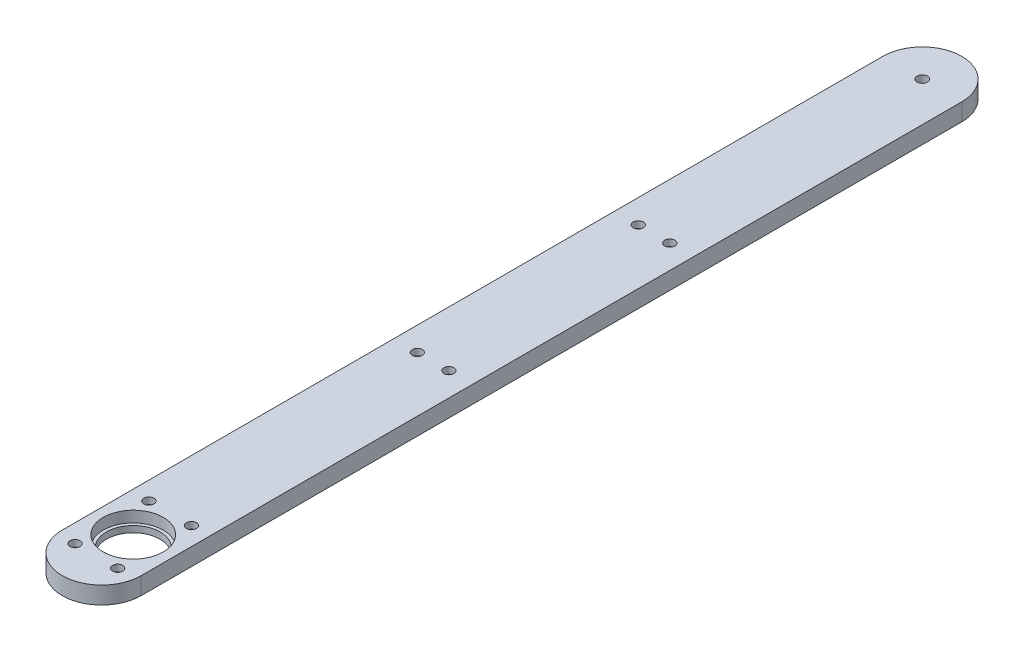
ISO-10303-21;
HEADER;
FILE_DESCRIPTION(('STEP AP214'),'2;1');
FILE_NAME('part.step','',(''),(''),'','','');
FILE_SCHEMA(('AUTOMOTIVE_DESIGN { 1 0 10303 214 1 1 1 1 }'));
ENDSEC;
DATA;
#1=APPLICATION_CONTEXT('core data for automotive mechanical design processes');
#2=APPLICATION_PROTOCOL_DEFINITION('international standard','automotive_design',2000,#1);
#3=PRODUCT_CONTEXT('',#1,'mechanical');
#4=PRODUCT('Part','Part','',(#3));
#5=PRODUCT_RELATED_PRODUCT_CATEGORY('part','',(#4));
#6=PRODUCT_DEFINITION_FORMATION('','',#4);
#7=PRODUCT_DEFINITION_CONTEXT('part definition',#1,'design');
#8=PRODUCT_DEFINITION('design','',#6,#7);
#9=PRODUCT_DEFINITION_SHAPE('','',#8);
#10=(LENGTH_UNIT() NAMED_UNIT(*) SI_UNIT(.MILLI.,.METRE.));
#11=(NAMED_UNIT(*) PLANE_ANGLE_UNIT() SI_UNIT($,.RADIAN.));
#12=(NAMED_UNIT(*) SI_UNIT($,.STERADIAN.) SOLID_ANGLE_UNIT());
#13=UNCERTAINTY_MEASURE_WITH_UNIT(LENGTH_MEASURE(1.E-05),#10,'distance_accuracy_value','');
#14=(GEOMETRIC_REPRESENTATION_CONTEXT(3) GLOBAL_UNCERTAINTY_ASSIGNED_CONTEXT((#13)) GLOBAL_UNIT_ASSIGNED_CONTEXT((#10,
#11,#12)) REPRESENTATION_CONTEXT('',''));
#15=CARTESIAN_POINT('',(0.,0.,0.));
#16=DIRECTION('',(0.,0.,1.));
#17=DIRECTION('',(1.,0.,0.));
#18=AXIS2_PLACEMENT_3D('',#15,#16,#17);
#19=CARTESIAN_POINT('',(5.00000000000004,-4.5,155.));
#20=DIRECTION('',(0.,-1.,0.));
#21=DIRECTION('',(0.,0.,-1.));
#22=AXIS2_PLACEMENT_3D('',#19,#20,#21);
#23=CYLINDRICAL_SURFACE('',#22,3.25);
#24=CARTESIAN_POINT('',(5.00000000000004,-1.1,155.));
#25=DIRECTION('',(0.,-1.,0.));
#26=DIRECTION('',(0.,0.,-1.));
#27=AXIS2_PLACEMENT_3D('',#24,#25,#26);
#28=CIRCLE('',#27,3.25);
#29=CARTESIAN_POINT('',(5.00000000000004,-1.1,151.75));
#30=VERTEX_POINT('',#29);
#31=EDGE_CURVE('E11',#30,#30,#28,.T.);
#32=ORIENTED_EDGE('',*,*,#31,.F.);
#33=EDGE_LOOP('',(#32));
#34=FACE_BOUND('',#33,.T.);
#35=CARTESIAN_POINT('',(5.00000000000004,-4.5,155.));
#36=DIRECTION('',(0.,-1.,0.));
#37=DIRECTION('',(0.,0.,-1.));
#38=AXIS2_PLACEMENT_3D('',#35,#36,#37);
#39=CIRCLE('',#38,3.25);
#40=CARTESIAN_POINT('',(5.00000000000004,-4.5,151.75));
#41=VERTEX_POINT('',#40);
#42=EDGE_CURVE('E173',#41,#41,#39,.T.);
#43=ORIENTED_EDGE('',*,*,#42,.T.);
#44=EDGE_LOOP('',(#43));
#45=FACE_BOUND('',#44,.T.);
#46=ADVANCED_FACE('F44',(#34,#45),#23,.F.);
#47=CARTESIAN_POINT('',(6.60000000000004,-1.1,155.));
#48=DIRECTION('',(0.,1.,0.));
#49=DIRECTION('',(0.,0.,1.));
#50=AXIS2_PLACEMENT_3D('',#47,#48,#49);
#51=PLANE('',#50);
#52=CARTESIAN_POINT('',(5.00000000000004,-1.1,155.));
#53=DIRECTION('',(0.,-1.,0.));
#54=DIRECTION('',(0.,0.,-1.));
#55=AXIS2_PLACEMENT_3D('',#52,#53,#54);
#56=CIRCLE('',#55,1.6);
#57=CARTESIAN_POINT('',(5.00000000000004,-1.1,153.4));
#58=VERTEX_POINT('',#57);
#59=EDGE_CURVE('E52',#58,#58,#56,.T.);
#60=ORIENTED_EDGE('',*,*,#59,.F.);
#61=EDGE_LOOP('',(#60));
#62=FACE_BOUND('',#61,.T.);
#63=ORIENTED_EDGE('',*,*,#31,.T.);
#64=EDGE_LOOP('',(#63));
#65=FACE_BOUND('',#64,.T.);
#66=ADVANCED_FACE('F187',(#62,#65),#51,.F.);
#67=CARTESIAN_POINT('',(5.00000000000004,-4.5,155.));
#68=DIRECTION('',(0.,-1.,0.));
#69=DIRECTION('',(0.,0.,-1.));
#70=AXIS2_PLACEMENT_3D('',#67,#68,#69);
#71=CYLINDRICAL_SURFACE('',#70,1.6);
#72=CARTESIAN_POINT('',(5.00000000000004,1.,155.));
#73=DIRECTION('',(0.,-1.,0.));
#74=DIRECTION('',(0.,0.,-1.));
#75=AXIS2_PLACEMENT_3D('',#72,#73,#74);
#76=CIRCLE('',#75,1.6);
#77=CARTESIAN_POINT('',(5.00000000000004,1.,153.4));
#78=VERTEX_POINT('',#77);
#79=EDGE_CURVE('E177',#78,#78,#76,.T.);
#80=ORIENTED_EDGE('',*,*,#79,.F.);
#81=EDGE_LOOP('',(#80));
#82=FACE_BOUND('',#81,.T.);
#83=ORIENTED_EDGE('',*,*,#59,.T.);
#84=EDGE_LOOP('',(#83));
#85=FACE_BOUND('',#84,.T.);
#86=ADVANCED_FACE('F185',(#82,#85),#71,.F.);
#87=CARTESIAN_POINT('',(5.00000000000002,-4.5,85.));
#88=DIRECTION('',(0.,-1.,0.));
#89=DIRECTION('',(0.,0.,-1.));
#90=AXIS2_PLACEMENT_3D('',#87,#88,#89);
#91=CYLINDRICAL_SURFACE('',#90,3.25);
#92=CARTESIAN_POINT('',(5.00000000000002,-1.1,85.));
#93=DIRECTION('',(0.,-1.,0.));
#94=DIRECTION('',(0.,0.,-1.));
#95=AXIS2_PLACEMENT_3D('',#92,#93,#94);
#96=CIRCLE('',#95,3.25);
#97=CARTESIAN_POINT('',(5.00000000000002,-1.1,81.75));
#98=VERTEX_POINT('',#97);
#99=EDGE_CURVE('E169',#98,#98,#96,.T.);
#100=ORIENTED_EDGE('',*,*,#99,.F.);
#101=EDGE_LOOP('',(#100));
#102=FACE_BOUND('',#101,.T.);
#103=CARTESIAN_POINT('',(5.00000000000002,-4.5,85.));
#104=DIRECTION('',(0.,-1.,0.));
#105=DIRECTION('',(0.,0.,-1.));
#106=AXIS2_PLACEMENT_3D('',#103,#104,#105);
#107=CIRCLE('',#106,3.25);
#108=CARTESIAN_POINT('',(5.00000000000002,-4.5,81.75));
#109=VERTEX_POINT('',#108);
#110=EDGE_CURVE('E157',#109,#109,#107,.T.);
#111=ORIENTED_EDGE('',*,*,#110,.T.);
#112=EDGE_LOOP('',(#111));
#113=FACE_BOUND('',#112,.T.);
#114=ADVANCED_FACE('F252',(#102,#113),#91,.F.);
#115=CARTESIAN_POINT('',(6.60000000000002,-1.1,85.));
#116=DIRECTION('',(0.,1.,0.));
#117=DIRECTION('',(0.,0.,1.));
#118=AXIS2_PLACEMENT_3D('',#115,#116,#117);
#119=PLANE('',#118);
#120=CARTESIAN_POINT('',(5.00000000000002,-1.1,85.));
#121=DIRECTION('',(0.,-1.,0.));
#122=DIRECTION('',(0.,0.,-1.));
#123=AXIS2_PLACEMENT_3D('',#120,#121,#122);
#124=CIRCLE('',#123,1.6);
#125=CARTESIAN_POINT('',(5.00000000000002,-1.1,83.4));
#126=VERTEX_POINT('',#125);
#127=EDGE_CURVE('E165',#126,#126,#124,.T.);
#128=ORIENTED_EDGE('',*,*,#127,.F.);
#129=EDGE_LOOP('',(#128));
#130=FACE_BOUND('',#129,.T.);
#131=ORIENTED_EDGE('',*,*,#99,.T.);
#132=EDGE_LOOP('',(#131));
#133=FACE_BOUND('',#132,.T.);
#134=ADVANCED_FACE('F248',(#130,#133),#119,.F.);
#135=CARTESIAN_POINT('',(5.00000000000002,-4.5,85.));
#136=DIRECTION('',(0.,-1.,0.));
#137=DIRECTION('',(0.,0.,-1.));
#138=AXIS2_PLACEMENT_3D('',#135,#136,#137);
#139=CYLINDRICAL_SURFACE('',#138,1.6);
#140=CARTESIAN_POINT('',(5.00000000000002,1.,85.));
#141=DIRECTION('',(0.,-1.,0.));
#142=DIRECTION('',(0.,0.,-1.));
#143=AXIS2_PLACEMENT_3D('',#140,#141,#142);
#144=CIRCLE('',#143,1.6);
#145=CARTESIAN_POINT('',(5.00000000000002,1.,83.4));
#146=VERTEX_POINT('',#145);
#147=EDGE_CURVE('E161',#146,#146,#144,.T.);
#148=ORIENTED_EDGE('',*,*,#147,.F.);
#149=EDGE_LOOP('',(#148));
#150=FACE_BOUND('',#149,.T.);
#151=ORIENTED_EDGE('',*,*,#127,.T.);
#152=EDGE_LOOP('',(#151));
#153=FACE_BOUND('',#152,.T.);
#154=ADVANCED_FACE('F244',(#150,#153),#139,.F.);
#155=CARTESIAN_POINT('',(-4.99999999999996,-4.5,155.));
#156=DIRECTION('',(0.,-1.,0.));
#157=DIRECTION('',(0.,0.,-1.));
#158=AXIS2_PLACEMENT_3D('',#155,#156,#157);
#159=CYLINDRICAL_SURFACE('',#158,3.25);
#160=CARTESIAN_POINT('',(-4.99999999999996,-1.1,155.));
#161=DIRECTION('',(0.,-1.,0.));
#162=DIRECTION('',(0.,0.,-1.));
#163=AXIS2_PLACEMENT_3D('',#160,#161,#162);
#164=CIRCLE('',#163,3.25);
#165=CARTESIAN_POINT('',(-4.99999999999996,-1.1,151.75));
#166=VERTEX_POINT('',#165);
#167=EDGE_CURVE('E153',#166,#166,#164,.T.);
#168=ORIENTED_EDGE('',*,*,#167,.F.);
#169=EDGE_LOOP('',(#168));
#170=FACE_BOUND('',#169,.T.);
#171=CARTESIAN_POINT('',(-4.99999999999996,-4.5,155.));
#172=DIRECTION('',(0.,-1.,0.));
#173=DIRECTION('',(0.,0.,-1.));
#174=AXIS2_PLACEMENT_3D('',#171,#172,#173);
#175=CIRCLE('',#174,3.25);
#176=CARTESIAN_POINT('',(-4.99999999999996,-4.5,151.75));
#177=VERTEX_POINT('',#176);
#178=EDGE_CURVE('E141',#177,#177,#175,.T.);
#179=ORIENTED_EDGE('',*,*,#178,.T.);
#180=EDGE_LOOP('',(#179));
#181=FACE_BOUND('',#180,.T.);
#182=ADVANCED_FACE('F240',(#170,#181),#159,.F.);
#183=CARTESIAN_POINT('',(-3.39999999999996,-1.1,155.));
#184=DIRECTION('',(0.,1.,0.));
#185=DIRECTION('',(0.,0.,1.));
#186=AXIS2_PLACEMENT_3D('',#183,#184,#185);
#187=PLANE('',#186);
#188=CARTESIAN_POINT('',(-4.99999999999996,-1.1,155.));
#189=DIRECTION('',(0.,-1.,0.));
#190=DIRECTION('',(0.,0.,-1.));
#191=AXIS2_PLACEMENT_3D('',#188,#189,#190);
#192=CIRCLE('',#191,1.6);
#193=CARTESIAN_POINT('',(-4.99999999999996,-1.1,153.4));
#194=VERTEX_POINT('',#193);
#195=EDGE_CURVE('E149',#194,#194,#192,.T.);
#196=ORIENTED_EDGE('',*,*,#195,.F.);
#197=EDGE_LOOP('',(#196));
#198=FACE_BOUND('',#197,.T.);
#199=ORIENTED_EDGE('',*,*,#167,.T.);
#200=EDGE_LOOP('',(#199));
#201=FACE_BOUND('',#200,.T.);
#202=ADVANCED_FACE('F209',(#198,#201),#187,.F.);
#203=CARTESIAN_POINT('',(-4.99999999999996,-4.5,155.));
#204=DIRECTION('',(0.,-1.,0.));
#205=DIRECTION('',(0.,0.,-1.));
#206=AXIS2_PLACEMENT_3D('',#203,#204,#205);
#207=CYLINDRICAL_SURFACE('',#206,1.6);
#208=CARTESIAN_POINT('',(-4.99999999999996,1.,155.));
#209=DIRECTION('',(0.,-1.,0.));
#210=DIRECTION('',(0.,0.,-1.));
#211=AXIS2_PLACEMENT_3D('',#208,#209,#210);
#212=CIRCLE('',#211,1.6);
#213=CARTESIAN_POINT('',(-4.99999999999996,1.,153.4));
#214=VERTEX_POINT('',#213);
#215=EDGE_CURVE('E145',#214,#214,#212,.T.);
#216=ORIENTED_EDGE('',*,*,#215,.F.);
#217=EDGE_LOOP('',(#216));
#218=FACE_BOUND('',#217,.T.);
#219=ORIENTED_EDGE('',*,*,#195,.T.);
#220=EDGE_LOOP('',(#219));
#221=FACE_BOUND('',#220,.T.);
#222=ADVANCED_FACE('F199',(#218,#221),#207,.F.);
#223=CARTESIAN_POINT('',(0.,-4.5,0.));
#224=DIRECTION('',(0.,1.,0.));
#225=DIRECTION('',(0.,0.,1.));
#226=AXIS2_PLACEMENT_3D('',#223,#224,#225);
#227=PLANE('',#226);
#228=CARTESIAN_POINT('',(-4.99999999999998,-4.5,85.));
#229=DIRECTION('',(0.,-1.,0.));
#230=DIRECTION('',(0.,0.,-1.));
#231=AXIS2_PLACEMENT_3D('',#228,#229,#230);
#232=CIRCLE('',#231,3.25);
#233=CARTESIAN_POINT('',(-4.99999999999998,-4.5,81.75));
#234=VERTEX_POINT('',#233);
#235=EDGE_CURVE('E404',#234,#234,#232,.T.);
#236=ORIENTED_EDGE('',*,*,#235,.F.);
#237=EDGE_LOOP('',(#236));
#238=FACE_BOUND('',#237,.T.);
#239=CARTESIAN_POINT('',(-6.7499999999999,-4.5,238.30865704891));
#240=DIRECTION('',(0.,-1.,0.));
#241=DIRECTION('',(0.,0.,-1.));
#242=AXIS2_PLACEMENT_3D('',#239,#240,#241);
#243=CIRCLE('',#242,3.25);
#244=CARTESIAN_POINT('',(-6.7499999999999,-4.5,235.05865704891));
#245=VERTEX_POINT('',#244);
#246=EDGE_CURVE('E357',#245,#245,#243,.T.);
#247=ORIENTED_EDGE('',*,*,#246,.F.);
#248=EDGE_LOOP('',(#247));
#249=FACE_BOUND('',#248,.T.);
#250=CARTESIAN_POINT('',(-6.75,-4.5,261.69134295109));
#251=DIRECTION('',(0.,-1.,0.));
#252=DIRECTION('',(0.,0.,-1.));
#253=AXIS2_PLACEMENT_3D('',#250,#251,#252);
#254=CIRCLE('',#253,3.25);
#255=CARTESIAN_POINT('',(-6.75,-4.5,258.44134295109));
#256=VERTEX_POINT('',#255);
#257=EDGE_CURVE('E341',#256,#256,#254,.T.);
#258=ORIENTED_EDGE('',*,*,#257,.F.);
#259=EDGE_LOOP('',(#258));
#260=FACE_BOUND('',#259,.T.);
#261=CARTESIAN_POINT('',(0.,-4.5,0.));
#262=DIRECTION('',(0.,1.,0.));
#263=DIRECTION('',(0.,0.,1.));
#264=AXIS2_PLACEMENT_3D('',#261,#262,#263);
#265=CIRCLE('',#264,6.);
#266=CARTESIAN_POINT('',(0.,-4.5,6.));
#267=VERTEX_POINT('',#266);
#268=EDGE_CURVE('E124',#267,#267,#265,.F.);
#269=ORIENTED_EDGE('',*,*,#268,.F.);
#270=EDGE_LOOP('',(#269));
#271=FACE_BOUND('',#270,.T.);
#272=CARTESIAN_POINT('',(0.,-4.5,0.));
#273=DIRECTION('',(0.,1.,0.));
#274=DIRECTION('',(0.,0.,1.));
#275=AXIS2_PLACEMENT_3D('',#272,#273,#274);
#276=CIRCLE('',#275,12.5);
#277=CARTESIAN_POINT('',(12.5,-4.5,0.));
#278=VERTEX_POINT('',#277);
#279=CARTESIAN_POINT('',(-12.5,-4.5,0.));
#280=VERTEX_POINT('',#279);
#281=EDGE_CURVE('E291',#278,#280,#276,.T.);
#282=ORIENTED_EDGE('',*,*,#281,.F.);
#283=DIRECTION('',(0.,0.,-1.));
#284=VECTOR('',#283,1.);
#285=CARTESIAN_POINT('',(12.5,-4.5,0.));
#286=LINE('',#285,#284);
#287=CARTESIAN_POINT('',(12.5,-4.5,260.));
#288=VERTEX_POINT('',#287);
#289=EDGE_CURVE('E116',#288,#278,#286,.T.);
#290=ORIENTED_EDGE('',*,*,#289,.F.);
#291=CARTESIAN_POINT('',(0.,-4.5,260.));
#292=DIRECTION('',(0.,1.,0.));
#293=DIRECTION('',(0.,0.,1.));
#294=AXIS2_PLACEMENT_3D('',#291,#292,#293);
#295=CIRCLE('',#294,12.5);
#296=CARTESIAN_POINT('',(-12.4999999999999,-4.5,260.));
#297=VERTEX_POINT('',#296);
#298=EDGE_CURVE('E304',#297,#288,#295,.T.);
#299=ORIENTED_EDGE('',*,*,#298,.F.);
#300=DIRECTION('',(0.,0.,1.));
#301=VECTOR('',#300,1.);
#302=CARTESIAN_POINT('',(-12.5,-4.5,0.));
#303=LINE('',#302,#301);
#304=EDGE_CURVE('E108',#280,#297,#303,.T.);
#305=ORIENTED_EDGE('',*,*,#304,.F.);
#306=EDGE_LOOP('',(#282,#290,#299,#305));
#307=FACE_BOUND('',#306,.T.);
#308=CARTESIAN_POINT('',(0.,-4.5,250.));
#309=DIRECTION('',(0.,-1.,0.));
#310=DIRECTION('',(0.,0.,-1.));
#311=AXIS2_PLACEMENT_3D('',#308,#309,#310);
#312=CIRCLE('',#311,8.5);
#313=CARTESIAN_POINT('',(0.,-4.5,241.5));
#314=VERTEX_POINT('',#313);
#315=EDGE_CURVE('E322',#314,#314,#312,.T.);
#316=ORIENTED_EDGE('',*,*,#315,.F.);
#317=EDGE_LOOP('',(#316));
#318=FACE_BOUND('',#317,.T.);
#319=CARTESIAN_POINT('',(6.75000000000005,-4.5,238.30865704891));
#320=DIRECTION('',(0.,-1.,0.));
#321=DIRECTION('',(0.,0.,-1.));
#322=AXIS2_PLACEMENT_3D('',#319,#320,#321);
#323=CIRCLE('',#322,3.25);
#324=CARTESIAN_POINT('',(6.75000000000005,-4.5,235.05865704891));
#325=VERTEX_POINT('',#324);
#326=EDGE_CURVE('E373',#325,#325,#323,.T.);
#327=ORIENTED_EDGE('',*,*,#326,.F.);
#328=EDGE_LOOP('',(#327));
#329=FACE_BOUND('',#328,.T.);
#330=CARTESIAN_POINT('',(6.74999999999987,-4.5,261.69134295109));
#331=DIRECTION('',(0.,-1.,0.));
#332=DIRECTION('',(0.,0.,-1.));
#333=AXIS2_PLACEMENT_3D('',#330,#331,#332);
#334=CIRCLE('',#333,3.25);
#335=CARTESIAN_POINT('',(6.74999999999987,-4.5,258.44134295109));
#336=VERTEX_POINT('',#335);
#337=EDGE_CURVE('E389',#336,#336,#334,.T.);
#338=ORIENTED_EDGE('',*,*,#337,.F.);
#339=EDGE_LOOP('',(#338));
#340=FACE_BOUND('',#339,.T.);
#341=ORIENTED_EDGE('',*,*,#178,.F.);
#342=EDGE_LOOP('',(#341));
#343=FACE_BOUND('',#342,.T.);
#344=ORIENTED_EDGE('',*,*,#110,.F.);
#345=EDGE_LOOP('',(#344));
#346=FACE_BOUND('',#345,.T.);
#347=ORIENTED_EDGE('',*,*,#42,.F.);
#348=EDGE_LOOP('',(#347));
#349=FACE_BOUND('',#348,.T.);
#350=ADVANCED_FACE('F196',(#238,#249,#260,#271,#307,#318,#329,#340,#343,#346,#349),#227,.F.);
#351=CARTESIAN_POINT('',(0.,2.5,250.));
#352=DIRECTION('',(0.,-1.,0.));
#353=DIRECTION('',(0.,0.,-1.));
#354=AXIS2_PLACEMENT_3D('',#351,#352,#353);
#355=CYLINDRICAL_SURFACE('',#354,9.50000000000001);
#356=CARTESIAN_POINT('',(0.,1.,250.));
#357=DIRECTION('',(0.,-1.,0.));
#358=DIRECTION('',(0.,0.,-1.));
#359=AXIS2_PLACEMENT_3D('',#356,#357,#358);
#360=CIRCLE('',#359,9.50000000000001);
#361=CARTESIAN_POINT('',(0.,1.,240.5));
#362=VERTEX_POINT('',#361);
#363=EDGE_CURVE('E93',#362,#362,#360,.F.);
#364=ORIENTED_EDGE('',*,*,#363,.T.);
#365=EDGE_LOOP('',(#364));
#366=FACE_BOUND('',#365,.T.);
#367=CARTESIAN_POINT('',(0.,-2.5,250.));
#368=DIRECTION('',(0.,-1.,0.));
#369=DIRECTION('',(0.,0.,-1.));
#370=AXIS2_PLACEMENT_3D('',#367,#368,#369);
#371=CIRCLE('',#370,9.50000000000001);
#372=CARTESIAN_POINT('',(0.,-2.5,240.5));
#373=VERTEX_POINT('',#372);
#374=EDGE_CURVE('E132',#373,#373,#371,.F.);
#375=ORIENTED_EDGE('',*,*,#374,.F.);
#376=EDGE_LOOP('',(#375));
#377=FACE_BOUND('',#376,.T.);
#378=ADVANCED_FACE('F198',(#366,#377),#355,.F.);
#379=CARTESIAN_POINT('',(0.,-4.5,0.));
#380=DIRECTION('',(0.,1.,0.));
#381=DIRECTION('',(0.,0.,1.));
#382=AXIS2_PLACEMENT_3D('',#379,#380,#381);
#383=CYLINDRICAL_SURFACE('',#382,12.5);
#384=CARTESIAN_POINT('',(0.,1.,0.));
#385=DIRECTION('',(0.,-1.,0.));
#386=DIRECTION('',(0.,0.,-1.));
#387=AXIS2_PLACEMENT_3D('',#384,#385,#386);
#388=CIRCLE('',#387,12.5);
#389=CARTESIAN_POINT('',(12.5,1.,0.));
#390=VERTEX_POINT('',#389);
#391=CARTESIAN_POINT('',(-12.5,1.,0.));
#392=VERTEX_POINT('',#391);
#393=EDGE_CURVE('E59',#390,#392,#388,.F.);
#394=ORIENTED_EDGE('',*,*,#393,.F.);
#395=DIRECTION('',(0.,1.,0.));
#396=VECTOR('',#395,1.);
#397=CARTESIAN_POINT('',(12.5,-4.5,0.));
#398=LINE('',#397,#396);
#399=EDGE_CURVE('E66',#278,#390,#398,.T.);
#400=ORIENTED_EDGE('',*,*,#399,.F.);
#401=ORIENTED_EDGE('',*,*,#281,.T.);
#402=DIRECTION('',(0.,1.,0.));
#403=VECTOR('',#402,1.);
#404=CARTESIAN_POINT('',(-12.5,-4.5,0.));
#405=LINE('',#404,#403);
#406=EDGE_CURVE('E110',#280,#392,#405,.T.);
#407=ORIENTED_EDGE('',*,*,#406,.T.);
#408=EDGE_LOOP('',(#394,#400,#401,#407));
#409=FACE_BOUND('',#408,.T.);
#410=ADVANCED_FACE('F206',(#409),#383,.T.);
#411=CARTESIAN_POINT('',(12.5,-4.5,0.));
#412=DIRECTION('',(1.,0.,0.));
#413=DIRECTION('',(0.,0.,-1.));
#414=AXIS2_PLACEMENT_3D('',#411,#412,#413);
#415=PLANE('',#414);
#416=DIRECTION('',(0.,0.,-1.));
#417=VECTOR('',#416,1.);
#418=CARTESIAN_POINT('',(12.5,1.,0.));
#419=LINE('',#418,#417);
#420=CARTESIAN_POINT('',(12.5,1.,260.));
#421=VERTEX_POINT('',#420);
#422=EDGE_CURVE('E103',#421,#390,#419,.T.);
#423=ORIENTED_EDGE('',*,*,#422,.F.);
#424=DIRECTION('',(0.,1.,0.));
#425=VECTOR('',#424,1.);
#426=CARTESIAN_POINT('',(12.5,-4.5,260.));
#427=LINE('',#426,#425);
#428=EDGE_CURVE('E101',#288,#421,#427,.T.);
#429=ORIENTED_EDGE('',*,*,#428,.F.);
#430=ORIENTED_EDGE('',*,*,#289,.T.);
#431=ORIENTED_EDGE('',*,*,#399,.T.);
#432=EDGE_LOOP('',(#423,#429,#430,#431));
#433=FACE_BOUND('',#432,.T.);
#434=ADVANCED_FACE('F218',(#433),#415,.T.);
#435=CARTESIAN_POINT('',(0.,-4.5,260.));
#436=DIRECTION('',(0.,1.,0.));
#437=DIRECTION('',(0.,0.,1.));
#438=AXIS2_PLACEMENT_3D('',#435,#436,#437);
#439=CYLINDRICAL_SURFACE('',#438,12.5);
#440=CARTESIAN_POINT('',(0.,1.,260.));
#441=DIRECTION('',(0.,-1.,0.));
#442=DIRECTION('',(0.,0.,-1.));
#443=AXIS2_PLACEMENT_3D('',#440,#441,#442);
#444=CIRCLE('',#443,12.5);
#445=CARTESIAN_POINT('',(-12.5,1.,260.));
#446=VERTEX_POINT('',#445);
#447=EDGE_CURVE('E87',#446,#421,#444,.F.);
#448=ORIENTED_EDGE('',*,*,#447,.F.);
#449=DIRECTION('',(0.,1.,0.));
#450=VECTOR('',#449,1.);
#451=CARTESIAN_POINT('',(-12.4999999999999,-4.5,260.));
#452=LINE('',#451,#450);
#453=EDGE_CURVE('E99',#297,#446,#452,.T.);
#454=ORIENTED_EDGE('',*,*,#453,.F.);
#455=ORIENTED_EDGE('',*,*,#298,.T.);
#456=ORIENTED_EDGE('',*,*,#428,.T.);
#457=EDGE_LOOP('',(#448,#454,#455,#456));
#458=FACE_BOUND('',#457,.T.);
#459=ADVANCED_FACE('F97',(#458),#439,.T.);
#460=CARTESIAN_POINT('',(-12.5,-4.5,0.));
#461=DIRECTION('',(-1.,0.,0.));
#462=DIRECTION('',(0.,0.,1.));
#463=AXIS2_PLACEMENT_3D('',#460,#461,#462);
#464=PLANE('',#463);
#465=DIRECTION('',(0.,0.,1.));
#466=VECTOR('',#465,1.);
#467=CARTESIAN_POINT('',(-12.5,1.,0.));
#468=LINE('',#467,#466);
#469=EDGE_CURVE('E83',#392,#446,#468,.T.);
#470=ORIENTED_EDGE('',*,*,#469,.F.);
#471=ORIENTED_EDGE('',*,*,#406,.F.);
#472=ORIENTED_EDGE('',*,*,#304,.T.);
#473=ORIENTED_EDGE('',*,*,#453,.T.);
#474=EDGE_LOOP('',(#470,#471,#472,#473));
#475=FACE_BOUND('',#474,.T.);
#476=ADVANCED_FACE('F106',(#475),#464,.T.);
#477=CARTESIAN_POINT('',(0.,-7.5,0.));
#478=DIRECTION('',(0.,1.,0.));
#479=DIRECTION('',(0.,0.,1.));
#480=AXIS2_PLACEMENT_3D('',#477,#478,#479);
#481=CYLINDRICAL_SURFACE('',#480,6.);
#482=CARTESIAN_POINT('',(0.,-7.5,0.));
#483=DIRECTION('',(0.,-1.,0.));
#484=DIRECTION('',(0.,0.,-1.));
#485=AXIS2_PLACEMENT_3D('',#482,#483,#484);
#486=CIRCLE('',#485,6.);
#487=CARTESIAN_POINT('',(0.,-7.5,-6.));
#488=VERTEX_POINT('',#487);
#489=EDGE_CURVE('E289',#488,#488,#486,.T.);
#490=ORIENTED_EDGE('',*,*,#489,.F.);
#491=EDGE_LOOP('',(#490));
#492=FACE_BOUND('',#491,.T.);
#493=ORIENTED_EDGE('',*,*,#268,.T.);
#494=EDGE_LOOP('',(#493));
#495=FACE_BOUND('',#494,.T.);
#496=ADVANCED_FACE('F216',(#492,#495),#481,.T.);
#497=CARTESIAN_POINT('',(0.,-7.5,0.));
#498=DIRECTION('',(0.,-1.,0.));
#499=DIRECTION('',(0.,0.,-1.));
#500=AXIS2_PLACEMENT_3D('',#497,#498,#499);
#501=PLANE('',#500);
#502=CARTESIAN_POINT('',(0.,-7.5,0.));
#503=DIRECTION('',(0.,-1.,0.));
#504=DIRECTION('',(0.,0.,-1.));
#505=AXIS2_PLACEMENT_3D('',#502,#503,#504);
#506=CIRCLE('',#505,5.);
#507=CARTESIAN_POINT('',(0.,-7.5,-5.));
#508=VERTEX_POINT('',#507);
#509=EDGE_CURVE('E128',#508,#508,#506,.F.);
#510=ORIENTED_EDGE('',*,*,#509,.T.);
#511=EDGE_LOOP('',(#510));
#512=FACE_BOUND('',#511,.T.);
#513=ORIENTED_EDGE('',*,*,#489,.T.);
#514=EDGE_LOOP('',(#513));
#515=FACE_BOUND('',#514,.T.);
#516=ADVANCED_FACE('F232',(#512,#515),#501,.T.);
#517=CARTESIAN_POINT('',(0.,-10.5,0.));
#518=DIRECTION('',(0.,1.,0.));
#519=DIRECTION('',(0.,0.,1.));
#520=AXIS2_PLACEMENT_3D('',#517,#518,#519);
#521=PLANE('',#520);
#522=CARTESIAN_POINT('',(0.,-10.5,0.));
#523=DIRECTION('',(0.,-1.,0.));
#524=DIRECTION('',(0.,0.,-1.));
#525=AXIS2_PLACEMENT_3D('',#522,#523,#524);
#526=CIRCLE('',#525,1.65);
#527=CARTESIAN_POINT('',(0.,-10.5,-1.65));
#528=VERTEX_POINT('',#527);
#529=EDGE_CURVE('E292',#528,#528,#526,.T.);
#530=ORIENTED_EDGE('',*,*,#529,.F.);
#531=EDGE_LOOP('',(#530));
#532=FACE_BOUND('',#531,.T.);
#533=CARTESIAN_POINT('',(0.,-10.5,0.));
#534=DIRECTION('',(0.,1.,0.));
#535=DIRECTION('',(0.,0.,1.));
#536=AXIS2_PLACEMENT_3D('',#533,#534,#535);
#537=CIRCLE('',#536,5.);
#538=CARTESIAN_POINT('',(0.,-10.5,5.));
#539=VERTEX_POINT('',#538);
#540=EDGE_CURVE('E120',#539,#539,#537,.T.);
#541=ORIENTED_EDGE('',*,*,#540,.F.);
#542=EDGE_LOOP('',(#541));
#543=FACE_BOUND('',#542,.T.);
#544=ADVANCED_FACE('F228',(#532,#543),#521,.F.);
#545=CARTESIAN_POINT('',(0.,-10.5,0.));
#546=DIRECTION('',(0.,1.,0.));
#547=DIRECTION('',(0.,0.,1.));
#548=AXIS2_PLACEMENT_3D('',#545,#546,#547);
#549=CYLINDRICAL_SURFACE('',#548,5.);
#550=ORIENTED_EDGE('',*,*,#509,.F.);
#551=EDGE_LOOP('',(#550));
#552=FACE_BOUND('',#551,.T.);
#553=ORIENTED_EDGE('',*,*,#540,.T.);
#554=EDGE_LOOP('',(#553));
#555=FACE_BOUND('',#554,.T.);
#556=ADVANCED_FACE('F231',(#552,#555),#549,.T.);
#557=CARTESIAN_POINT('',(0.,-10.5,0.));
#558=DIRECTION('',(0.,-1.,0.));
#559=DIRECTION('',(0.,0.,-1.));
#560=AXIS2_PLACEMENT_3D('',#557,#558,#559);
#561=CYLINDRICAL_SURFACE('',#560,1.65);
#562=CARTESIAN_POINT('',(0.,0.999999999999999,0.));
#563=DIRECTION('',(0.,-1.,0.));
#564=DIRECTION('',(0.,0.,-1.));
#565=AXIS2_PLACEMENT_3D('',#562,#563,#564);
#566=CIRCLE('',#565,1.65);
#567=CARTESIAN_POINT('',(0.,0.999999999999999,-1.65));
#568=VERTEX_POINT('',#567);
#569=EDGE_CURVE('E133',#568,#568,#566,.F.);
#570=ORIENTED_EDGE('',*,*,#569,.T.);
#571=EDGE_LOOP('',(#570));
#572=FACE_BOUND('',#571,.T.);
#573=ORIENTED_EDGE('',*,*,#529,.T.);
#574=EDGE_LOOP('',(#573));
#575=FACE_BOUND('',#574,.T.);
#576=ADVANCED_FACE('F235',(#572,#575),#561,.F.);
#577=CARTESIAN_POINT('',(-23.3733322792316,1.,-1111.));
#578=DIRECTION('',(0.,-1.,0.));
#579=DIRECTION('',(0.,0.,-1.));
#580=AXIS2_PLACEMENT_3D('',#577,#578,#579);
#581=PLANE('',#580);
#582=CARTESIAN_POINT('',(-4.99999999999998,1.,85.));
#583=DIRECTION('',(0.,-1.,0.));
#584=DIRECTION('',(0.,0.,-1.));
#585=AXIS2_PLACEMENT_3D('',#582,#583,#584);
#586=CIRCLE('',#585,1.6);
#587=CARTESIAN_POINT('',(-4.99999999999998,1.,83.4));
#588=VERTEX_POINT('',#587);
#589=EDGE_CURVE('E401',#588,#588,#586,.T.);
#590=ORIENTED_EDGE('',*,*,#589,.T.);
#591=EDGE_LOOP('',(#590));
#592=FACE_BOUND('',#591,.T.);
#593=CARTESIAN_POINT('',(6.74999999999987,1.,261.69134295109));
#594=DIRECTION('',(0.,-1.,0.));
#595=DIRECTION('',(0.,0.,-1.));
#596=AXIS2_PLACEMENT_3D('',#593,#594,#595);
#597=CIRCLE('',#596,1.6);
#598=CARTESIAN_POINT('',(6.74999999999987,1.,260.09134295109));
#599=VERTEX_POINT('',#598);
#600=EDGE_CURVE('E377',#599,#599,#597,.T.);
#601=ORIENTED_EDGE('',*,*,#600,.T.);
#602=EDGE_LOOP('',(#601));
#603=FACE_BOUND('',#602,.T.);
#604=CARTESIAN_POINT('',(6.75000000000005,1.,238.30865704891));
#605=DIRECTION('',(0.,-1.,0.));
#606=DIRECTION('',(0.,0.,-1.));
#607=AXIS2_PLACEMENT_3D('',#604,#605,#606);
#608=CIRCLE('',#607,1.6);
#609=CARTESIAN_POINT('',(6.75000000000005,1.,236.70865704891));
#610=VERTEX_POINT('',#609);
#611=EDGE_CURVE('E361',#610,#610,#608,.T.);
#612=ORIENTED_EDGE('',*,*,#611,.T.);
#613=EDGE_LOOP('',(#612));
#614=FACE_BOUND('',#613,.T.);
#615=CARTESIAN_POINT('',(-6.7499999999999,1.,238.30865704891));
#616=DIRECTION('',(0.,-1.,0.));
#617=DIRECTION('',(0.,0.,-1.));
#618=AXIS2_PLACEMENT_3D('',#615,#616,#617);
#619=CIRCLE('',#618,1.6);
#620=CARTESIAN_POINT('',(-6.7499999999999,1.,236.70865704891));
#621=VERTEX_POINT('',#620);
#622=EDGE_CURVE('E345',#621,#621,#619,.T.);
#623=ORIENTED_EDGE('',*,*,#622,.T.);
#624=EDGE_LOOP('',(#623));
#625=FACE_BOUND('',#624,.T.);
#626=CARTESIAN_POINT('',(-6.75,1.,261.69134295109));
#627=DIRECTION('',(0.,-1.,0.));
#628=DIRECTION('',(0.,0.,-1.));
#629=AXIS2_PLACEMENT_3D('',#626,#627,#628);
#630=CIRCLE('',#629,1.6);
#631=CARTESIAN_POINT('',(-6.75,1.,260.09134295109));
#632=VERTEX_POINT('',#631);
#633=EDGE_CURVE('E326',#632,#632,#630,.T.);
#634=ORIENTED_EDGE('',*,*,#633,.T.);
#635=EDGE_LOOP('',(#634));
#636=FACE_BOUND('',#635,.T.);
#637=ORIENTED_EDGE('',*,*,#393,.T.);
#638=ORIENTED_EDGE('',*,*,#469,.T.);
#639=ORIENTED_EDGE('',*,*,#447,.T.);
#640=ORIENTED_EDGE('',*,*,#422,.T.);
#641=EDGE_LOOP('',(#637,#638,#639,#640));
#642=FACE_BOUND('',#641,.T.);
#643=ORIENTED_EDGE('',*,*,#569,.F.);
#644=EDGE_LOOP('',(#643));
#645=FACE_BOUND('',#644,.T.);
#646=ORIENTED_EDGE('',*,*,#363,.F.);
#647=EDGE_LOOP('',(#646));
#648=FACE_BOUND('',#647,.T.);
#649=ORIENTED_EDGE('',*,*,#215,.T.);
#650=EDGE_LOOP('',(#649));
#651=FACE_BOUND('',#650,.T.);
#652=ORIENTED_EDGE('',*,*,#147,.T.);
#653=EDGE_LOOP('',(#652));
#654=FACE_BOUND('',#653,.T.);
#655=ORIENTED_EDGE('',*,*,#79,.T.);
#656=EDGE_LOOP('',(#655));
#657=FACE_BOUND('',#656,.T.);
#658=ADVANCED_FACE('F85',(#592,#603,#614,#625,#636,#642,#645,#648,#651,#654,#657),#581,.F.);
#659=CARTESIAN_POINT('',(0.,-2.5,250.));
#660=DIRECTION('',(0.,-1.,0.));
#661=DIRECTION('',(0.,0.,-1.));
#662=AXIS2_PLACEMENT_3D('',#659,#660,#661);
#663=PLANE('',#662);
#664=CARTESIAN_POINT('',(0.,-2.5,250.));
#665=DIRECTION('',(0.,-1.,0.));
#666=DIRECTION('',(0.,0.,-1.));
#667=AXIS2_PLACEMENT_3D('',#664,#665,#666);
#668=CIRCLE('',#667,8.5);
#669=CARTESIAN_POINT('',(0.,-2.5,241.5));
#670=VERTEX_POINT('',#669);
#671=EDGE_CURVE('E137',#670,#670,#668,.T.);
#672=ORIENTED_EDGE('',*,*,#671,.T.);
#673=EDGE_LOOP('',(#672));
#674=FACE_BOUND('',#673,.T.);
#675=ORIENTED_EDGE('',*,*,#374,.T.);
#676=EDGE_LOOP('',(#675));
#677=FACE_BOUND('',#676,.T.);
#678=ADVANCED_FACE('F264',(#674,#677),#663,.F.);
#679=CARTESIAN_POINT('',(0.,-2.5,250.));
#680=DIRECTION('',(0.,-1.,0.));
#681=DIRECTION('',(0.,0.,-1.));
#682=AXIS2_PLACEMENT_3D('',#679,#680,#681);
#683=CYLINDRICAL_SURFACE('',#682,8.5);
#684=ORIENTED_EDGE('',*,*,#671,.F.);
#685=EDGE_LOOP('',(#684));
#686=FACE_BOUND('',#685,.T.);
#687=ORIENTED_EDGE('',*,*,#315,.T.);
#688=EDGE_LOOP('',(#687));
#689=FACE_BOUND('',#688,.T.);
#690=ADVANCED_FACE('F271',(#686,#689),#683,.F.);
#691=CARTESIAN_POINT('',(-6.75,-4.5,261.69134295109));
#692=DIRECTION('',(0.,-1.,0.));
#693=DIRECTION('',(0.,0.,-1.));
#694=AXIS2_PLACEMENT_3D('',#691,#692,#693);
#695=CYLINDRICAL_SURFACE('',#694,1.60000000000001);
#696=ORIENTED_EDGE('',*,*,#633,.F.);
#697=EDGE_LOOP('',(#696));
#698=FACE_BOUND('',#697,.T.);
#699=CARTESIAN_POINT('',(-6.75,-1.1,261.69134295109));
#700=DIRECTION('',(0.,-1.,0.));
#701=DIRECTION('',(0.,0.,-1.));
#702=AXIS2_PLACEMENT_3D('',#699,#700,#701);
#703=CIRCLE('',#702,1.60000000000001);
#704=CARTESIAN_POINT('',(-6.75,-1.1,260.09134295109));
#705=VERTEX_POINT('',#704);
#706=EDGE_CURVE('E333',#705,#705,#703,.T.);
#707=ORIENTED_EDGE('',*,*,#706,.T.);
#708=EDGE_LOOP('',(#707));
#709=FACE_BOUND('',#708,.T.);
#710=ADVANCED_FACE('F468',(#698,#709),#695,.F.);
#711=CARTESIAN_POINT('',(-5.14999999999998,-1.1,261.69134295109));
#712=DIRECTION('',(0.,1.,0.));
#713=DIRECTION('',(0.,0.,1.));
#714=AXIS2_PLACEMENT_3D('',#711,#712,#713);
#715=PLANE('',#714);
#716=ORIENTED_EDGE('',*,*,#706,.F.);
#717=EDGE_LOOP('',(#716));
#718=FACE_BOUND('',#717,.T.);
#719=CARTESIAN_POINT('',(-6.75,-1.1,261.69134295109));
#720=DIRECTION('',(0.,-1.,0.));
#721=DIRECTION('',(0.,0.,-1.));
#722=AXIS2_PLACEMENT_3D('',#719,#720,#721);
#723=CIRCLE('',#722,3.25);
#724=CARTESIAN_POINT('',(-6.75,-1.1,258.44134295109));
#725=VERTEX_POINT('',#724);
#726=EDGE_CURVE('E337',#725,#725,#723,.T.);
#727=ORIENTED_EDGE('',*,*,#726,.T.);
#728=EDGE_LOOP('',(#727));
#729=FACE_BOUND('',#728,.T.);
#730=ADVANCED_FACE('F464',(#718,#729),#715,.F.);
#731=CARTESIAN_POINT('',(-6.75,-4.5,261.69134295109));
#732=DIRECTION('',(0.,-1.,0.));
#733=DIRECTION('',(0.,0.,-1.));
#734=AXIS2_PLACEMENT_3D('',#731,#732,#733);
#735=CYLINDRICAL_SURFACE('',#734,3.25);
#736=ORIENTED_EDGE('',*,*,#726,.F.);
#737=EDGE_LOOP('',(#736));
#738=FACE_BOUND('',#737,.T.);
#739=ORIENTED_EDGE('',*,*,#257,.T.);
#740=EDGE_LOOP('',(#739));
#741=FACE_BOUND('',#740,.T.);
#742=ADVANCED_FACE('F460',(#738,#741),#735,.F.);
#743=CARTESIAN_POINT('',(-6.7499999999999,-4.5,238.30865704891));
#744=DIRECTION('',(0.,-1.,0.));
#745=DIRECTION('',(0.,0.,-1.));
#746=AXIS2_PLACEMENT_3D('',#743,#744,#745);
#747=CYLINDRICAL_SURFACE('',#746,1.60000000000001);
#748=ORIENTED_EDGE('',*,*,#622,.F.);
#749=EDGE_LOOP('',(#748));
#750=FACE_BOUND('',#749,.T.);
#751=CARTESIAN_POINT('',(-6.7499999999999,-1.1,238.30865704891));
#752=DIRECTION('',(0.,-1.,0.));
#753=DIRECTION('',(0.,0.,-1.));
#754=AXIS2_PLACEMENT_3D('',#751,#752,#753);
#755=CIRCLE('',#754,1.60000000000001);
#756=CARTESIAN_POINT('',(-6.7499999999999,-1.1,236.70865704891));
#757=VERTEX_POINT('',#756);
#758=EDGE_CURVE('E349',#757,#757,#755,.T.);
#759=ORIENTED_EDGE('',*,*,#758,.T.);
#760=EDGE_LOOP('',(#759));
#761=FACE_BOUND('',#760,.T.);
#762=ADVANCED_FACE('F456',(#750,#761),#747,.F.);
#763=CARTESIAN_POINT('',(-5.14999999999988,-1.1,238.30865704891));
#764=DIRECTION('',(0.,1.,0.));
#765=DIRECTION('',(0.,0.,1.));
#766=AXIS2_PLACEMENT_3D('',#763,#764,#765);
#767=PLANE('',#766);
#768=ORIENTED_EDGE('',*,*,#758,.F.);
#769=EDGE_LOOP('',(#768));
#770=FACE_BOUND('',#769,.T.);
#771=CARTESIAN_POINT('',(-6.7499999999999,-1.1,238.30865704891));
#772=DIRECTION('',(0.,-1.,0.));
#773=DIRECTION('',(0.,0.,-1.));
#774=AXIS2_PLACEMENT_3D('',#771,#772,#773);
#775=CIRCLE('',#774,3.25);
#776=CARTESIAN_POINT('',(-6.7499999999999,-1.1,235.05865704891));
#777=VERTEX_POINT('',#776);
#778=EDGE_CURVE('E353',#777,#777,#775,.T.);
#779=ORIENTED_EDGE('',*,*,#778,.T.);
#780=EDGE_LOOP('',(#779));
#781=FACE_BOUND('',#780,.T.);
#782=ADVANCED_FACE('F452',(#770,#781),#767,.F.);
#783=CARTESIAN_POINT('',(-6.7499999999999,-4.5,238.30865704891));
#784=DIRECTION('',(0.,-1.,0.));
#785=DIRECTION('',(0.,0.,-1.));
#786=AXIS2_PLACEMENT_3D('',#783,#784,#785);
#787=CYLINDRICAL_SURFACE('',#786,3.25);
#788=ORIENTED_EDGE('',*,*,#778,.F.);
#789=EDGE_LOOP('',(#788));
#790=FACE_BOUND('',#789,.T.);
#791=ORIENTED_EDGE('',*,*,#246,.T.);
#792=EDGE_LOOP('',(#791));
#793=FACE_BOUND('',#792,.T.);
#794=ADVANCED_FACE('F448',(#790,#793),#787,.F.);
#795=CARTESIAN_POINT('',(6.75000000000005,-4.5,238.30865704891));
#796=DIRECTION('',(0.,-1.,0.));
#797=DIRECTION('',(0.,0.,-1.));
#798=AXIS2_PLACEMENT_3D('',#795,#796,#797);
#799=CYLINDRICAL_SURFACE('',#798,1.60000000000001);
#800=ORIENTED_EDGE('',*,*,#611,.F.);
#801=EDGE_LOOP('',(#800));
#802=FACE_BOUND('',#801,.T.);
#803=CARTESIAN_POINT('',(6.75000000000005,-1.1,238.30865704891));
#804=DIRECTION('',(0.,-1.,0.));
#805=DIRECTION('',(0.,0.,-1.));
#806=AXIS2_PLACEMENT_3D('',#803,#804,#805);
#807=CIRCLE('',#806,1.60000000000001);
#808=CARTESIAN_POINT('',(6.75000000000005,-1.1,236.70865704891));
#809=VERTEX_POINT('',#808);
#810=EDGE_CURVE('E365',#809,#809,#807,.T.);
#811=ORIENTED_EDGE('',*,*,#810,.T.);
#812=EDGE_LOOP('',(#811));
#813=FACE_BOUND('',#812,.T.);
#814=ADVANCED_FACE('F444',(#802,#813),#799,.F.);
#815=CARTESIAN_POINT('',(8.35000000000007,-1.1,238.30865704891));
#816=DIRECTION('',(0.,1.,0.));
#817=DIRECTION('',(0.,0.,1.));
#818=AXIS2_PLACEMENT_3D('',#815,#816,#817);
#819=PLANE('',#818);
#820=ORIENTED_EDGE('',*,*,#810,.F.);
#821=EDGE_LOOP('',(#820));
#822=FACE_BOUND('',#821,.T.);
#823=CARTESIAN_POINT('',(6.75000000000005,-1.1,238.30865704891));
#824=DIRECTION('',(0.,-1.,0.));
#825=DIRECTION('',(0.,0.,-1.));
#826=AXIS2_PLACEMENT_3D('',#823,#824,#825);
#827=CIRCLE('',#826,3.25);
#828=CARTESIAN_POINT('',(6.75000000000005,-1.1,235.05865704891));
#829=VERTEX_POINT('',#828);
#830=EDGE_CURVE('E369',#829,#829,#827,.T.);
#831=ORIENTED_EDGE('',*,*,#830,.T.);
#832=EDGE_LOOP('',(#831));
#833=FACE_BOUND('',#832,.T.);
#834=ADVANCED_FACE('F440',(#822,#833),#819,.F.);
#835=CARTESIAN_POINT('',(6.75000000000005,-4.5,238.30865704891));
#836=DIRECTION('',(0.,-1.,0.));
#837=DIRECTION('',(0.,0.,-1.));
#838=AXIS2_PLACEMENT_3D('',#835,#836,#837);
#839=CYLINDRICAL_SURFACE('',#838,3.25);
#840=ORIENTED_EDGE('',*,*,#830,.F.);
#841=EDGE_LOOP('',(#840));
#842=FACE_BOUND('',#841,.T.);
#843=ORIENTED_EDGE('',*,*,#326,.T.);
#844=EDGE_LOOP('',(#843));
#845=FACE_BOUND('',#844,.T.);
#846=ADVANCED_FACE('F436',(#842,#845),#839,.F.);
#847=CARTESIAN_POINT('',(6.74999999999987,-4.5,261.69134295109));
#848=DIRECTION('',(0.,-1.,0.));
#849=DIRECTION('',(0.,0.,-1.));
#850=AXIS2_PLACEMENT_3D('',#847,#848,#849);
#851=CYLINDRICAL_SURFACE('',#850,1.60000000000001);
#852=ORIENTED_EDGE('',*,*,#600,.F.);
#853=EDGE_LOOP('',(#852));
#854=FACE_BOUND('',#853,.T.);
#855=CARTESIAN_POINT('',(6.74999999999987,-1.1,261.69134295109));
#856=DIRECTION('',(0.,-1.,0.));
#857=DIRECTION('',(0.,0.,-1.));
#858=AXIS2_PLACEMENT_3D('',#855,#856,#857);
#859=CIRCLE('',#858,1.60000000000001);
#860=CARTESIAN_POINT('',(6.74999999999987,-1.1,260.09134295109));
#861=VERTEX_POINT('',#860);
#862=EDGE_CURVE('E381',#861,#861,#859,.T.);
#863=ORIENTED_EDGE('',*,*,#862,.T.);
#864=EDGE_LOOP('',(#863));
#865=FACE_BOUND('',#864,.T.);
#866=ADVANCED_FACE('F432',(#854,#865),#851,.F.);
#867=CARTESIAN_POINT('',(8.34999999999988,-1.1,261.69134295109));
#868=DIRECTION('',(0.,1.,0.));
#869=DIRECTION('',(0.,0.,1.));
#870=AXIS2_PLACEMENT_3D('',#867,#868,#869);
#871=PLANE('',#870);
#872=ORIENTED_EDGE('',*,*,#862,.F.);
#873=EDGE_LOOP('',(#872));
#874=FACE_BOUND('',#873,.T.);
#875=CARTESIAN_POINT('',(6.74999999999987,-1.1,261.69134295109));
#876=DIRECTION('',(0.,-1.,0.));
#877=DIRECTION('',(0.,0.,-1.));
#878=AXIS2_PLACEMENT_3D('',#875,#876,#877);
#879=CIRCLE('',#878,3.25);
#880=CARTESIAN_POINT('',(6.74999999999987,-1.1,258.44134295109));
#881=VERTEX_POINT('',#880);
#882=EDGE_CURVE('E385',#881,#881,#879,.T.);
#883=ORIENTED_EDGE('',*,*,#882,.T.);
#884=EDGE_LOOP('',(#883));
#885=FACE_BOUND('',#884,.T.);
#886=ADVANCED_FACE('F428',(#874,#885),#871,.F.);
#887=CARTESIAN_POINT('',(6.74999999999987,-4.5,261.69134295109));
#888=DIRECTION('',(0.,-1.,0.));
#889=DIRECTION('',(0.,0.,-1.));
#890=AXIS2_PLACEMENT_3D('',#887,#888,#889);
#891=CYLINDRICAL_SURFACE('',#890,3.25);
#892=ORIENTED_EDGE('',*,*,#882,.F.);
#893=EDGE_LOOP('',(#892));
#894=FACE_BOUND('',#893,.T.);
#895=ORIENTED_EDGE('',*,*,#337,.T.);
#896=EDGE_LOOP('',(#895));
#897=FACE_BOUND('',#896,.T.);
#898=ADVANCED_FACE('F424',(#894,#897),#891,.F.);
#899=CARTESIAN_POINT('',(-4.99999999999998,-4.5,85.));
#900=DIRECTION('',(0.,-1.,0.));
#901=DIRECTION('',(0.,0.,-1.));
#902=AXIS2_PLACEMENT_3D('',#899,#900,#901);
#903=CYLINDRICAL_SURFACE('',#902,1.6);
#904=ORIENTED_EDGE('',*,*,#589,.F.);
#905=EDGE_LOOP('',(#904));
#906=FACE_BOUND('',#905,.T.);
#907=CARTESIAN_POINT('',(-4.99999999999998,-1.1,85.));
#908=DIRECTION('',(0.,-1.,0.));
#909=DIRECTION('',(0.,0.,-1.));
#910=AXIS2_PLACEMENT_3D('',#907,#908,#909);
#911=CIRCLE('',#910,1.6);
#912=CARTESIAN_POINT('',(-4.99999999999998,-1.1,83.4));
#913=VERTEX_POINT('',#912);
#914=EDGE_CURVE('E393',#913,#913,#911,.T.);
#915=ORIENTED_EDGE('',*,*,#914,.T.);
#916=EDGE_LOOP('',(#915));
#917=FACE_BOUND('',#916,.T.);
#918=ADVANCED_FACE('F417',(#906,#917),#903,.F.);
#919=CARTESIAN_POINT('',(-3.39999999999998,-1.1,85.));
#920=DIRECTION('',(0.,1.,0.));
#921=DIRECTION('',(0.,0.,1.));
#922=AXIS2_PLACEMENT_3D('',#919,#920,#921);
#923=PLANE('',#922);
#924=ORIENTED_EDGE('',*,*,#914,.F.);
#925=EDGE_LOOP('',(#924));
#926=FACE_BOUND('',#925,.T.);
#927=CARTESIAN_POINT('',(-4.99999999999998,-1.1,85.));
#928=DIRECTION('',(0.,-1.,0.));
#929=DIRECTION('',(0.,0.,-1.));
#930=AXIS2_PLACEMENT_3D('',#927,#928,#929);
#931=CIRCLE('',#930,3.25);
#932=CARTESIAN_POINT('',(-4.99999999999998,-1.1,81.75));
#933=VERTEX_POINT('',#932);
#934=EDGE_CURVE('E397',#933,#933,#931,.T.);
#935=ORIENTED_EDGE('',*,*,#934,.T.);
#936=EDGE_LOOP('',(#935));
#937=FACE_BOUND('',#936,.T.);
#938=ADVANCED_FACE('F411',(#926,#937),#923,.F.);
#939=CARTESIAN_POINT('',(-4.99999999999998,-4.5,85.));
#940=DIRECTION('',(0.,-1.,0.));
#941=DIRECTION('',(0.,0.,-1.));
#942=AXIS2_PLACEMENT_3D('',#939,#940,#941);
#943=CYLINDRICAL_SURFACE('',#942,3.25);
#944=ORIENTED_EDGE('',*,*,#934,.F.);
#945=EDGE_LOOP('',(#944));
#946=FACE_BOUND('',#945,.T.);
#947=ORIENTED_EDGE('',*,*,#235,.T.);
#948=EDGE_LOOP('',(#947));
#949=FACE_BOUND('',#948,.T.);
#950=ADVANCED_FACE('F409',(#946,#949),#943,.F.);
#951=CLOSED_SHELL('',(#46,#66,#86,#114,#134,#154,#182,#202,#222,#350,#378,#410,#434,#459,#476,
#496,#516,#544,#556,#576,#658,#678,#690,#710,#730,#742,#762,#782,#794,#814,#834,#846,#866,#886,
#898,#918,#938,#950));
#952=MANIFOLD_SOLID_BREP('B2',#951);
#953=ADVANCED_BREP_SHAPE_REPRESENTATION('',(#18,#952),#14);
#954=SHAPE_DEFINITION_REPRESENTATION(#9,#953);
ENDSEC;
END-ISO-10303-21;
